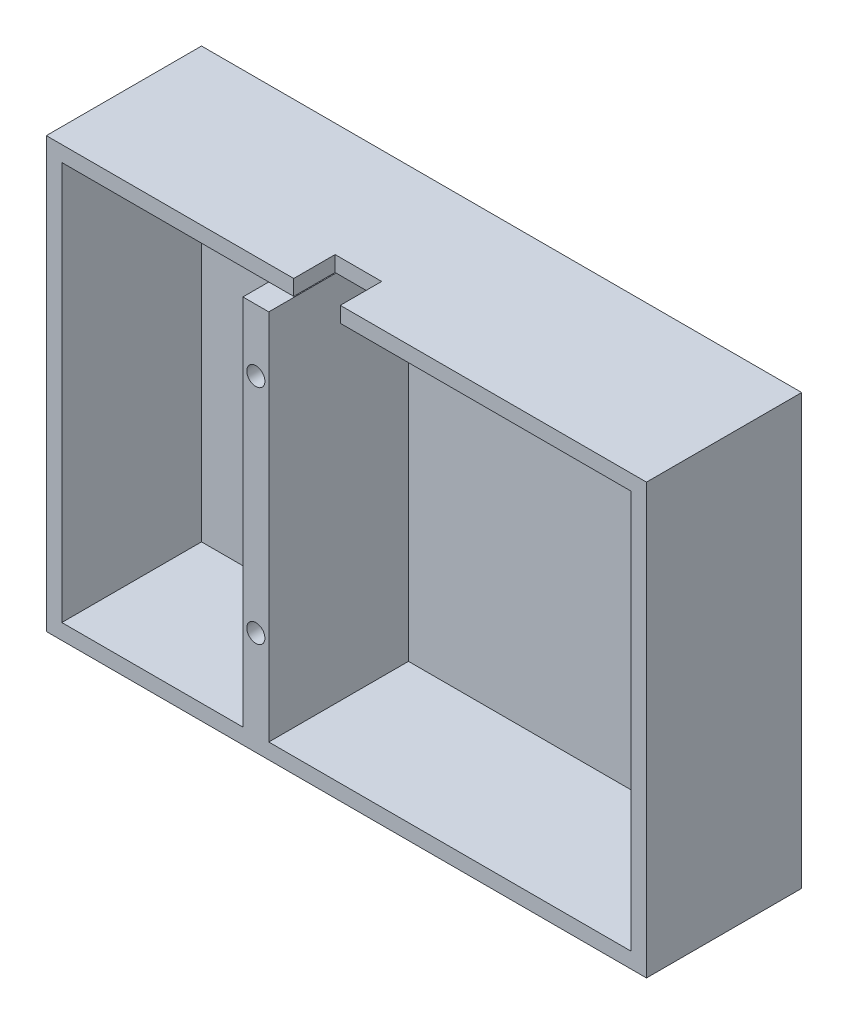
ISO-10303-21;
HEADER;
FILE_DESCRIPTION(('STEP AP214'),'2;1');
FILE_NAME('part.step','',(''),(''),'','','');
FILE_SCHEMA(('AUTOMOTIVE_DESIGN { 1 0 10303 214 1 1 1 1 }'));
ENDSEC;
DATA;
#1=APPLICATION_CONTEXT('core data for automotive mechanical design processes');
#2=APPLICATION_PROTOCOL_DEFINITION('international standard','automotive_design',2000,#1);
#3=PRODUCT_CONTEXT('',#1,'mechanical');
#4=PRODUCT('Part','Part','',(#3));
#5=PRODUCT_RELATED_PRODUCT_CATEGORY('part','',(#4));
#6=PRODUCT_DEFINITION_FORMATION('','',#4);
#7=PRODUCT_DEFINITION_CONTEXT('part definition',#1,'design');
#8=PRODUCT_DEFINITION('design','',#6,#7);
#9=PRODUCT_DEFINITION_SHAPE('','',#8);
#10=(LENGTH_UNIT() NAMED_UNIT(*) SI_UNIT(.MILLI.,.METRE.));
#11=(NAMED_UNIT(*) PLANE_ANGLE_UNIT() SI_UNIT($,.RADIAN.));
#12=(NAMED_UNIT(*) SI_UNIT($,.STERADIAN.) SOLID_ANGLE_UNIT());
#13=UNCERTAINTY_MEASURE_WITH_UNIT(LENGTH_MEASURE(1.E-05),#10,'distance_accuracy_value','');
#14=(GEOMETRIC_REPRESENTATION_CONTEXT(3) GLOBAL_UNCERTAINTY_ASSIGNED_CONTEXT((#13)) GLOBAL_UNIT_ASSIGNED_CONTEXT((#10,
#11,#12)) REPRESENTATION_CONTEXT('',''));
#15=CARTESIAN_POINT('',(0.,0.,0.));
#16=DIRECTION('',(0.,0.,1.));
#17=DIRECTION('',(1.,0.,0.));
#18=AXIS2_PLACEMENT_3D('',#15,#16,#17);
#19=CARTESIAN_POINT('',(0.,0.,30.));
#20=DIRECTION('',(0.,0.,1.));
#21=DIRECTION('',(1.,0.,0.));
#22=AXIS2_PLACEMENT_3D('',#19,#20,#21);
#23=PLANE('',#22);
#24=CARTESIAN_POINT('',(-75.5,63.,30.));
#25=DIRECTION('',(0.,0.,1.));
#26=DIRECTION('',(1.,0.,0.));
#27=AXIS2_PLACEMENT_3D('',#24,#25,#26);
#28=CIRCLE('',#27,1.75);
#29=CARTESIAN_POINT('',(-73.75,63.,30.));
#30=VERTEX_POINT('',#29);
#31=EDGE_CURVE('E180',#30,#30,#28,.T.);
#32=ORIENTED_EDGE('',*,*,#31,.F.);
#33=EDGE_LOOP('',(#32));
#34=FACE_BOUND('',#33,.T.);
#35=CARTESIAN_POINT('',(-75.5,20.,30.));
#36=DIRECTION('',(0.,0.,1.));
#37=DIRECTION('',(1.,0.,0.));
#38=AXIS2_PLACEMENT_3D('',#35,#36,#37);
#39=CIRCLE('',#38,1.75);
#40=CARTESIAN_POINT('',(-73.75,20.,30.));
#41=VERTEX_POINT('',#40);
#42=EDGE_CURVE('E172',#41,#41,#39,.T.);
#43=ORIENTED_EDGE('',*,*,#42,.F.);
#44=EDGE_LOOP('',(#43));
#45=FACE_BOUND('',#44,.T.);
#46=DIRECTION('',(-1.,0.,0.));
#47=VECTOR('',#46,1.);
#48=CARTESIAN_POINT('',(-116.,83.,30.));
#49=LINE('',#48,#47);
#50=CARTESIAN_POINT('',(0.,83.,30.));
#51=VERTEX_POINT('',#50);
#52=CARTESIAN_POINT('',(-59.1821793356738,83.,30.));
#53=VERTEX_POINT('',#52);
#54=EDGE_CURVE('E266',#51,#53,#49,.T.);
#55=ORIENTED_EDGE('',*,*,#54,.T.);
#56=DIRECTION('',(0.,1.,0.));
#57=VECTOR('',#56,1.);
#58=CARTESIAN_POINT('',(-59.1821793356738,73.,30.));
#59=LINE('',#58,#57);
#60=CARTESIAN_POINT('',(-59.1821793356738,80.,30.));
#61=VERTEX_POINT('',#60);
#62=EDGE_CURVE('E161',#61,#53,#59,.T.);
#63=ORIENTED_EDGE('',*,*,#62,.F.);
#64=DIRECTION('',(-1.,0.,0.));
#65=VECTOR('',#64,1.);
#66=CARTESIAN_POINT('',(-73.,80.,30.));
#67=LINE('',#66,#65);
#68=CARTESIAN_POINT('',(-3.,80.,30.));
#69=VERTEX_POINT('',#68);
#70=EDGE_CURVE('E244',#69,#61,#67,.T.);
#71=ORIENTED_EDGE('',*,*,#70,.F.);
#72=DIRECTION('',(0.,1.,0.));
#73=VECTOR('',#72,1.);
#74=CARTESIAN_POINT('',(-3.,80.,30.));
#75=LINE('',#74,#73);
#76=CARTESIAN_POINT('',(-3.00000000000002,3.00000000000004,30.));
#77=VERTEX_POINT('',#76);
#78=EDGE_CURVE('E240',#77,#69,#75,.T.);
#79=ORIENTED_EDGE('',*,*,#78,.F.);
#80=DIRECTION('',(1.,0.,0.));
#81=VECTOR('',#80,1.);
#82=CARTESIAN_POINT('',(-73.,3.00000000000005,30.));
#83=LINE('',#82,#81);
#84=CARTESIAN_POINT('',(-73.,3.00000000000005,30.));
#85=VERTEX_POINT('',#84);
#86=EDGE_CURVE('E238',#85,#77,#83,.T.);
#87=ORIENTED_EDGE('',*,*,#86,.F.);
#88=DIRECTION('',(0.,-1.,0.));
#89=VECTOR('',#88,1.);
#90=CARTESIAN_POINT('',(-73.,80.,30.));
#91=LINE('',#90,#89);
#92=CARTESIAN_POINT('',(-73.,75.,30.));
#93=VERTEX_POINT('',#92);
#94=EDGE_CURVE('E236',#93,#85,#91,.T.);
#95=ORIENTED_EDGE('',*,*,#94,.F.);
#96=DIRECTION('',(1.,0.,0.));
#97=VECTOR('',#96,1.);
#98=CARTESIAN_POINT('',(-78.,75.,30.));
#99=LINE('',#98,#97);
#100=CARTESIAN_POINT('',(-78.,75.,30.));
#101=VERTEX_POINT('',#100);
#102=EDGE_CURVE('E196',#101,#93,#99,.T.);
#103=ORIENTED_EDGE('',*,*,#102,.F.);
#104=DIRECTION('',(0.,1.,0.));
#105=VECTOR('',#104,1.);
#106=CARTESIAN_POINT('',(-78.,80.,30.));
#107=LINE('',#106,#105);
#108=CARTESIAN_POINT('',(-78.,3.,30.));
#109=VERTEX_POINT('',#108);
#110=EDGE_CURVE('E224',#109,#101,#107,.T.);
#111=ORIENTED_EDGE('',*,*,#110,.F.);
#112=DIRECTION('',(1.,0.,0.));
#113=VECTOR('',#112,1.);
#114=CARTESIAN_POINT('',(-113.,3.,30.));
#115=LINE('',#114,#113);
#116=CARTESIAN_POINT('',(-113.,3.,30.));
#117=VERTEX_POINT('',#116);
#118=EDGE_CURVE('E222',#117,#109,#115,.T.);
#119=ORIENTED_EDGE('',*,*,#118,.F.);
#120=DIRECTION('',(0.,-1.,0.));
#121=VECTOR('',#120,1.);
#122=CARTESIAN_POINT('',(-113.,80.,30.));
#123=LINE('',#122,#121);
#124=CARTESIAN_POINT('',(-113.,80.,30.));
#125=VERTEX_POINT('',#124);
#126=EDGE_CURVE('E220',#125,#117,#123,.T.);
#127=ORIENTED_EDGE('',*,*,#126,.F.);
#128=CARTESIAN_POINT('',(-68.1821793356738,80.,30.));
#129=VERTEX_POINT('',#128);
#130=EDGE_CURVE('E243',#129,#125,#67,.T.);
#131=ORIENTED_EDGE('',*,*,#130,.F.);
#132=DIRECTION('',(0.,1.,0.));
#133=VECTOR('',#132,1.);
#134=CARTESIAN_POINT('',(-68.1821793356738,73.,30.));
#135=LINE('',#134,#133);
#136=CARTESIAN_POINT('',(-68.1821793356738,83.,30.));
#137=VERTEX_POINT('',#136);
#138=EDGE_CURVE('E173',#129,#137,#135,.T.);
#139=ORIENTED_EDGE('',*,*,#138,.T.);
#140=CARTESIAN_POINT('',(-116.,83.,30.));
#141=VERTEX_POINT('',#140);
#142=EDGE_CURVE('E265',#137,#141,#49,.T.);
#143=ORIENTED_EDGE('',*,*,#142,.T.);
#144=DIRECTION('',(0.,-1.,0.));
#145=VECTOR('',#144,1.);
#146=CARTESIAN_POINT('',(-116.,83.,30.));
#147=LINE('',#146,#145);
#148=CARTESIAN_POINT('',(-116.,0.,30.));
#149=VERTEX_POINT('',#148);
#150=EDGE_CURVE('E257',#141,#149,#147,.T.);
#151=ORIENTED_EDGE('',*,*,#150,.T.);
#152=DIRECTION('',(1.,0.,0.));
#153=VECTOR('',#152,1.);
#154=CARTESIAN_POINT('',(-116.,0.,30.));
#155=LINE('',#154,#153);
#156=CARTESIAN_POINT('',(0.,0.,30.));
#157=VERTEX_POINT('',#156);
#158=EDGE_CURVE('E260',#149,#157,#155,.T.);
#159=ORIENTED_EDGE('',*,*,#158,.T.);
#160=DIRECTION('',(0.,1.,0.));
#161=VECTOR('',#160,1.);
#162=CARTESIAN_POINT('',(0.,83.,30.));
#163=LINE('',#162,#161);
#164=EDGE_CURVE('E263',#157,#51,#163,.T.);
#165=ORIENTED_EDGE('',*,*,#164,.T.);
#166=EDGE_LOOP('',(#55,#63,#71,#79,#87,#95,#103,#111,#119,#127,#131,#139,#143,#151,#159,#165));
#167=FACE_BOUND('',#166,.T.);
#168=ADVANCED_FACE('F33',(#34,#45,#167),#23,.T.);
#169=CARTESIAN_POINT('',(-116.,83.,30.));
#170=DIRECTION('',(0.,-1.,0.));
#171=DIRECTION('',(0.,0.,-1.));
#172=AXIS2_PLACEMENT_3D('',#169,#170,#171);
#173=PLANE('',#172);
#174=DIRECTION('',(0.,0.,1.));
#175=VECTOR('',#174,1.);
#176=CARTESIAN_POINT('',(-59.1821793356738,83.,0.));
#177=LINE('',#176,#175);
#178=CARTESIAN_POINT('',(-59.1821793356738,83.,22.));
#179=VERTEX_POINT('',#178);
#180=EDGE_CURVE('E158',#179,#53,#177,.T.);
#181=ORIENTED_EDGE('',*,*,#180,.T.);
#182=ORIENTED_EDGE('',*,*,#54,.F.);
#183=DIRECTION('',(0.,0.,-1.));
#184=VECTOR('',#183,1.);
#185=CARTESIAN_POINT('',(0.,83.,30.));
#186=LINE('',#185,#184);
#187=CARTESIAN_POINT('',(0.,83.,0.));
#188=VERTEX_POINT('',#187);
#189=EDGE_CURVE('E278',#51,#188,#186,.T.);
#190=ORIENTED_EDGE('',*,*,#189,.T.);
#191=DIRECTION('',(-1.,0.,0.));
#192=VECTOR('',#191,1.);
#193=CARTESIAN_POINT('',(-116.,83.,0.));
#194=LINE('',#193,#192);
#195=CARTESIAN_POINT('',(-116.,83.,0.));
#196=VERTEX_POINT('',#195);
#197=EDGE_CURVE('E261',#188,#196,#194,.T.);
#198=ORIENTED_EDGE('',*,*,#197,.T.);
#199=DIRECTION('',(0.,0.,-1.));
#200=VECTOR('',#199,1.);
#201=CARTESIAN_POINT('',(-116.,83.,30.));
#202=LINE('',#201,#200);
#203=EDGE_CURVE('E268',#141,#196,#202,.T.);
#204=ORIENTED_EDGE('',*,*,#203,.F.);
#205=ORIENTED_EDGE('',*,*,#142,.F.);
#206=DIRECTION('',(0.,0.,-1.));
#207=VECTOR('',#206,1.);
#208=CARTESIAN_POINT('',(-68.1821793356738,83.,0.));
#209=LINE('',#208,#207);
#210=CARTESIAN_POINT('',(-68.1821793356738,83.,22.));
#211=VERTEX_POINT('',#210);
#212=EDGE_CURVE('E155',#137,#211,#209,.T.);
#213=ORIENTED_EDGE('',*,*,#212,.T.);
#214=DIRECTION('',(1.,0.,0.));
#215=VECTOR('',#214,1.);
#216=CARTESIAN_POINT('',(0.,83.,22.));
#217=LINE('',#216,#215);
#218=EDGE_CURVE('E150',#211,#179,#217,.T.);
#219=ORIENTED_EDGE('',*,*,#218,.T.);
#220=EDGE_LOOP('',(#181,#182,#190,#198,#204,#205,#213,#219));
#221=FACE_BOUND('',#220,.T.);
#222=ADVANCED_FACE('F166',(#221),#173,.F.);
#223=CARTESIAN_POINT('',(-73.,80.,30.));
#224=DIRECTION('',(0.,-1.,0.));
#225=DIRECTION('',(1.,0.,0.));
#226=AXIS2_PLACEMENT_3D('',#223,#224,#225);
#227=PLANE('',#226);
#228=ORIENTED_EDGE('',*,*,#70,.T.);
#229=DIRECTION('',(0.,0.,-1.));
#230=VECTOR('',#229,1.);
#231=CARTESIAN_POINT('',(-59.1821793356738,80.,30.));
#232=LINE('',#231,#230);
#233=CARTESIAN_POINT('',(-59.1821793356738,80.,22.));
#234=VERTEX_POINT('',#233);
#235=EDGE_CURVE('E11',#61,#234,#232,.T.);
#236=ORIENTED_EDGE('',*,*,#235,.T.);
#237=DIRECTION('',(-1.,0.,0.));
#238=VECTOR('',#237,1.);
#239=CARTESIAN_POINT('',(-73.,80.,22.));
#240=LINE('',#239,#238);
#241=CARTESIAN_POINT('',(-68.1821793356738,80.,22.));
#242=VERTEX_POINT('',#241);
#243=EDGE_CURVE('E153',#234,#242,#240,.T.);
#244=ORIENTED_EDGE('',*,*,#243,.T.);
#245=DIRECTION('',(0.,0.,1.));
#246=VECTOR('',#245,1.);
#247=CARTESIAN_POINT('',(-68.1821793356738,80.,30.));
#248=LINE('',#247,#246);
#249=EDGE_CURVE('E41',#242,#129,#248,.T.);
#250=ORIENTED_EDGE('',*,*,#249,.T.);
#251=ORIENTED_EDGE('',*,*,#130,.T.);
#252=DIRECTION('',(0.,0.,-1.));
#253=VECTOR('',#252,1.);
#254=CARTESIAN_POINT('',(-113.,80.,30.));
#255=LINE('',#254,#253);
#256=CARTESIAN_POINT('',(-113.,80.,3.));
#257=VERTEX_POINT('',#256);
#258=EDGE_CURVE('E227',#125,#257,#255,.T.);
#259=ORIENTED_EDGE('',*,*,#258,.T.);
#260=DIRECTION('',(1.,0.,0.));
#261=VECTOR('',#260,1.);
#262=CARTESIAN_POINT('',(-3.,80.,3.));
#263=LINE('',#262,#261);
#264=CARTESIAN_POINT('',(-3.,80.,3.));
#265=VERTEX_POINT('',#264);
#266=EDGE_CURVE('E216',#257,#265,#263,.T.);
#267=ORIENTED_EDGE('',*,*,#266,.T.);
#268=DIRECTION('',(0.,0.,-1.));
#269=VECTOR('',#268,1.);
#270=CARTESIAN_POINT('',(-3.,80.,30.));
#271=LINE('',#270,#269);
#272=EDGE_CURVE('E247',#69,#265,#271,.T.);
#273=ORIENTED_EDGE('',*,*,#272,.F.);
#274=EDGE_LOOP('',(#228,#236,#244,#250,#251,#259,#267,#273));
#275=FACE_BOUND('',#274,.T.);
#276=ADVANCED_FACE('F290',(#275),#227,.T.);
#277=CARTESIAN_POINT('',(0.,0.,0.));
#278=DIRECTION('',(0.,0.,1.));
#279=DIRECTION('',(1.,0.,0.));
#280=AXIS2_PLACEMENT_3D('',#277,#278,#279);
#281=PLANE('',#280);
#282=CARTESIAN_POINT('',(-75.5,20.,0.));
#283=DIRECTION('',(0.,0.,1.));
#284=DIRECTION('',(1.,0.,0.));
#285=AXIS2_PLACEMENT_3D('',#282,#283,#284);
#286=CIRCLE('',#285,1.75);
#287=CARTESIAN_POINT('',(-73.75,20.,0.));
#288=VERTEX_POINT('',#287);
#289=EDGE_CURVE('E177',#288,#288,#286,.T.);
#290=ORIENTED_EDGE('',*,*,#289,.T.);
#291=EDGE_LOOP('',(#290));
#292=FACE_BOUND('',#291,.T.);
#293=CARTESIAN_POINT('',(-75.5,63.,0.));
#294=DIRECTION('',(0.,0.,1.));
#295=DIRECTION('',(1.,0.,0.));
#296=AXIS2_PLACEMENT_3D('',#293,#294,#295);
#297=CIRCLE('',#296,1.75);
#298=CARTESIAN_POINT('',(-73.75,63.,0.));
#299=VERTEX_POINT('',#298);
#300=EDGE_CURVE('E183',#299,#299,#297,.T.);
#301=ORIENTED_EDGE('',*,*,#300,.T.);
#302=EDGE_LOOP('',(#301));
#303=FACE_BOUND('',#302,.T.);
#304=DIRECTION('',(0.,-1.,0.));
#305=VECTOR('',#304,1.);
#306=CARTESIAN_POINT('',(-116.,83.,0.));
#307=LINE('',#306,#305);
#308=CARTESIAN_POINT('',(-116.,0.,0.));
#309=VERTEX_POINT('',#308);
#310=EDGE_CURVE('E256',#196,#309,#307,.T.);
#311=ORIENTED_EDGE('',*,*,#310,.F.);
#312=ORIENTED_EDGE('',*,*,#197,.F.);
#313=DIRECTION('',(0.,1.,0.));
#314=VECTOR('',#313,1.);
#315=CARTESIAN_POINT('',(0.,83.,0.));
#316=LINE('',#315,#314);
#317=CARTESIAN_POINT('',(0.,0.,0.));
#318=VERTEX_POINT('',#317);
#319=EDGE_CURVE('E273',#318,#188,#316,.T.);
#320=ORIENTED_EDGE('',*,*,#319,.F.);
#321=DIRECTION('',(1.,0.,0.));
#322=VECTOR('',#321,1.);
#323=CARTESIAN_POINT('',(-116.,0.,0.));
#324=LINE('',#323,#322);
#325=EDGE_CURVE('E271',#309,#318,#324,.T.);
#326=ORIENTED_EDGE('',*,*,#325,.F.);
#327=EDGE_LOOP('',(#311,#312,#320,#326));
#328=FACE_BOUND('',#327,.T.);
#329=ADVANCED_FACE('F325',(#292,#303,#328),#281,.F.);
#330=CARTESIAN_POINT('',(-116.,83.,30.));
#331=DIRECTION('',(1.,0.,0.));
#332=DIRECTION('',(0.,1.,0.));
#333=AXIS2_PLACEMENT_3D('',#330,#331,#332);
#334=PLANE('',#333);
#335=ORIENTED_EDGE('',*,*,#310,.T.);
#336=DIRECTION('',(0.,0.,-1.));
#337=VECTOR('',#336,1.);
#338=CARTESIAN_POINT('',(-116.,0.,30.));
#339=LINE('',#338,#337);
#340=EDGE_CURVE('E284',#149,#309,#339,.T.);
#341=ORIENTED_EDGE('',*,*,#340,.F.);
#342=ORIENTED_EDGE('',*,*,#150,.F.);
#343=ORIENTED_EDGE('',*,*,#203,.T.);
#344=EDGE_LOOP('',(#335,#341,#342,#343));
#345=FACE_BOUND('',#344,.T.);
#346=ADVANCED_FACE('F35',(#345),#334,.F.);
#347=CARTESIAN_POINT('',(-116.,0.,30.));
#348=DIRECTION('',(0.,1.,0.));
#349=DIRECTION('',(0.,0.,1.));
#350=AXIS2_PLACEMENT_3D('',#347,#348,#349);
#351=PLANE('',#350);
#352=CARTESIAN_POINT('',(-12.5,0.,8.));
#353=DIRECTION('',(0.,-1.,0.));
#354=DIRECTION('',(0.,0.,-1.));
#355=AXIS2_PLACEMENT_3D('',#352,#353,#354);
#356=CIRCLE('',#355,5.);
#357=CARTESIAN_POINT('',(-12.5,0.,3.));
#358=VERTEX_POINT('',#357);
#359=EDGE_CURVE('E186',#358,#358,#356,.T.);
#360=ORIENTED_EDGE('',*,*,#359,.F.);
#361=EDGE_LOOP('',(#360));
#362=FACE_BOUND('',#361,.T.);
#363=ORIENTED_EDGE('',*,*,#325,.T.);
#364=DIRECTION('',(0.,0.,-1.));
#365=VECTOR('',#364,1.);
#366=CARTESIAN_POINT('',(0.,0.,30.));
#367=LINE('',#366,#365);
#368=EDGE_CURVE('E281',#157,#318,#367,.T.);
#369=ORIENTED_EDGE('',*,*,#368,.F.);
#370=ORIENTED_EDGE('',*,*,#158,.F.);
#371=ORIENTED_EDGE('',*,*,#340,.T.);
#372=EDGE_LOOP('',(#363,#369,#370,#371));
#373=FACE_BOUND('',#372,.T.);
#374=ADVANCED_FACE('F331',(#362,#373),#351,.F.);
#375=CARTESIAN_POINT('',(0.,83.,30.));
#376=DIRECTION('',(-1.,0.,0.));
#377=DIRECTION('',(0.,0.,1.));
#378=AXIS2_PLACEMENT_3D('',#375,#376,#377);
#379=PLANE('',#378);
#380=ORIENTED_EDGE('',*,*,#319,.T.);
#381=ORIENTED_EDGE('',*,*,#189,.F.);
#382=ORIENTED_EDGE('',*,*,#164,.F.);
#383=ORIENTED_EDGE('',*,*,#368,.T.);
#384=EDGE_LOOP('',(#380,#381,#382,#383));
#385=FACE_BOUND('',#384,.T.);
#386=ADVANCED_FACE('F332',(#385),#379,.F.);
#387=CARTESIAN_POINT('',(-73.,80.,30.));
#388=DIRECTION('',(1.,0.,0.));
#389=DIRECTION('',(0.,1.,0.));
#390=AXIS2_PLACEMENT_3D('',#387,#388,#389);
#391=PLANE('',#390);
#392=DIRECTION('',(0.,0.,-1.));
#393=VECTOR('',#392,1.);
#394=CARTESIAN_POINT('',(-73.,75.,30.));
#395=LINE('',#394,#393);
#396=CARTESIAN_POINT('',(-73.,75.,3.00000000000001));
#397=VERTEX_POINT('',#396);
#398=EDGE_CURVE('E192',#93,#397,#395,.T.);
#399=ORIENTED_EDGE('',*,*,#398,.F.);
#400=ORIENTED_EDGE('',*,*,#94,.T.);
#401=DIRECTION('',(0.,0.,-1.));
#402=VECTOR('',#401,1.);
#403=CARTESIAN_POINT('',(-73.,3.00000000000005,30.));
#404=LINE('',#403,#402);
#405=CARTESIAN_POINT('',(-73.,3.00000000000005,3.));
#406=VERTEX_POINT('',#405);
#407=EDGE_CURVE('E253',#85,#406,#404,.T.);
#408=ORIENTED_EDGE('',*,*,#407,.T.);
#409=DIRECTION('',(0.,1.,0.));
#410=VECTOR('',#409,1.);
#411=CARTESIAN_POINT('',(-73.,80.,3.));
#412=LINE('',#411,#410);
#413=EDGE_CURVE('E213',#406,#397,#412,.T.);
#414=ORIENTED_EDGE('',*,*,#413,.T.);
#415=EDGE_LOOP('',(#399,#400,#408,#414));
#416=FACE_BOUND('',#415,.T.);
#417=ADVANCED_FACE('F334',(#416),#391,.T.);
#418=CARTESIAN_POINT('',(-73.,3.00000000000005,30.));
#419=DIRECTION('',(0.,1.,0.));
#420=DIRECTION('',(-1.,0.,0.));
#421=AXIS2_PLACEMENT_3D('',#418,#419,#420);
#422=PLANE('',#421);
#423=DIRECTION('',(-1.,0.,0.));
#424=VECTOR('',#423,1.);
#425=CARTESIAN_POINT('',(-73.,3.00000000000005,3.));
#426=LINE('',#425,#424);
#427=CARTESIAN_POINT('',(-3.00000000000002,3.00000000000004,3.));
#428=VERTEX_POINT('',#427);
#429=CARTESIAN_POINT('',(-12.5,3.00000000000004,3.));
#430=VERTEX_POINT('',#429);
#431=EDGE_CURVE('E210',#428,#430,#426,.T.);
#432=ORIENTED_EDGE('',*,*,#431,.T.);
#433=CARTESIAN_POINT('',(-12.5,3.00000000000005,8.));
#434=DIRECTION('',(0.,1.,0.));
#435=DIRECTION('',(-1.,0.,0.));
#436=AXIS2_PLACEMENT_3D('',#433,#434,#435);
#437=CIRCLE('',#436,5.);
#438=EDGE_CURVE('E54',#430,#430,#437,.T.);
#439=ORIENTED_EDGE('',*,*,#438,.F.);
#440=EDGE_CURVE('E209',#430,#406,#426,.T.);
#441=ORIENTED_EDGE('',*,*,#440,.T.);
#442=ORIENTED_EDGE('',*,*,#407,.F.);
#443=ORIENTED_EDGE('',*,*,#86,.T.);
#444=DIRECTION('',(0.,0.,-1.));
#445=VECTOR('',#444,1.);
#446=CARTESIAN_POINT('',(-3.00000000000002,3.00000000000004,30.));
#447=LINE('',#446,#445);
#448=EDGE_CURVE('E250',#77,#428,#447,.T.);
#449=ORIENTED_EDGE('',*,*,#448,.T.);
#450=EDGE_LOOP('',(#432,#439,#441,#442,#443,#449));
#451=FACE_BOUND('',#450,.T.);
#452=ADVANCED_FACE('F340',(#451),#422,.T.);
#453=CARTESIAN_POINT('',(-3.,80.,30.));
#454=DIRECTION('',(-1.,0.,0.));
#455=DIRECTION('',(0.,-1.,0.));
#456=AXIS2_PLACEMENT_3D('',#453,#454,#455);
#457=PLANE('',#456);
#458=DIRECTION('',(0.,-1.,0.));
#459=VECTOR('',#458,1.);
#460=CARTESIAN_POINT('',(-3.00000000000002,3.00000000000004,3.));
#461=LINE('',#460,#459);
#462=EDGE_CURVE('E218',#265,#428,#461,.T.);
#463=ORIENTED_EDGE('',*,*,#462,.T.);
#464=ORIENTED_EDGE('',*,*,#448,.F.);
#465=ORIENTED_EDGE('',*,*,#78,.T.);
#466=ORIENTED_EDGE('',*,*,#272,.T.);
#467=EDGE_LOOP('',(#463,#464,#465,#466));
#468=FACE_BOUND('',#467,.T.);
#469=ADVANCED_FACE('F312',(#468),#457,.T.);
#470=CARTESIAN_POINT('',(-113.,80.,30.));
#471=DIRECTION('',(1.,0.,0.));
#472=DIRECTION('',(0.,1.,0.));
#473=AXIS2_PLACEMENT_3D('',#470,#471,#472);
#474=PLANE('',#473);
#475=DIRECTION('',(0.,1.,0.));
#476=VECTOR('',#475,1.);
#477=CARTESIAN_POINT('',(-113.,80.,3.));
#478=LINE('',#477,#476);
#479=CARTESIAN_POINT('',(-113.,3.,3.));
#480=VERTEX_POINT('',#479);
#481=EDGE_CURVE('E201',#480,#257,#478,.T.);
#482=ORIENTED_EDGE('',*,*,#481,.T.);
#483=ORIENTED_EDGE('',*,*,#258,.F.);
#484=ORIENTED_EDGE('',*,*,#126,.T.);
#485=DIRECTION('',(0.,0.,-1.));
#486=VECTOR('',#485,1.);
#487=CARTESIAN_POINT('',(-113.,3.,30.));
#488=LINE('',#487,#486);
#489=EDGE_CURVE('E233',#117,#480,#488,.T.);
#490=ORIENTED_EDGE('',*,*,#489,.T.);
#491=EDGE_LOOP('',(#482,#483,#484,#490));
#492=FACE_BOUND('',#491,.T.);
#493=ADVANCED_FACE('F299',(#492),#474,.T.);
#494=CARTESIAN_POINT('',(-113.,3.,30.));
#495=DIRECTION('',(0.,1.,0.));
#496=DIRECTION('',(0.,0.,1.));
#497=AXIS2_PLACEMENT_3D('',#494,#495,#496);
#498=PLANE('',#497);
#499=DIRECTION('',(-1.,0.,0.));
#500=VECTOR('',#499,1.);
#501=CARTESIAN_POINT('',(-113.,3.,3.));
#502=LINE('',#501,#500);
#503=CARTESIAN_POINT('',(-78.,3.,3.));
#504=VERTEX_POINT('',#503);
#505=EDGE_CURVE('E207',#504,#480,#502,.T.);
#506=ORIENTED_EDGE('',*,*,#505,.T.);
#507=ORIENTED_EDGE('',*,*,#489,.F.);
#508=ORIENTED_EDGE('',*,*,#118,.T.);
#509=DIRECTION('',(0.,0.,-1.));
#510=VECTOR('',#509,1.);
#511=CARTESIAN_POINT('',(-78.,3.,30.));
#512=LINE('',#511,#510);
#513=EDGE_CURVE('E230',#109,#504,#512,.T.);
#514=ORIENTED_EDGE('',*,*,#513,.T.);
#515=EDGE_LOOP('',(#506,#507,#508,#514));
#516=FACE_BOUND('',#515,.T.);
#517=ADVANCED_FACE('F302',(#516),#498,.T.);
#518=CARTESIAN_POINT('',(-78.,80.,30.));
#519=DIRECTION('',(-1.,0.,0.));
#520=DIRECTION('',(0.,-1.,0.));
#521=AXIS2_PLACEMENT_3D('',#518,#519,#520);
#522=PLANE('',#521);
#523=DIRECTION('',(0.,0.,-1.));
#524=VECTOR('',#523,1.);
#525=CARTESIAN_POINT('',(-78.,75.,30.));
#526=LINE('',#525,#524);
#527=CARTESIAN_POINT('',(-78.,75.,3.00000000000001));
#528=VERTEX_POINT('',#527);
#529=EDGE_CURVE('E193',#101,#528,#526,.T.);
#530=ORIENTED_EDGE('',*,*,#529,.T.);
#531=DIRECTION('',(0.,-1.,0.));
#532=VECTOR('',#531,1.);
#533=CARTESIAN_POINT('',(-78.,3.,3.));
#534=LINE('',#533,#532);
#535=EDGE_CURVE('E205',#528,#504,#534,.T.);
#536=ORIENTED_EDGE('',*,*,#535,.T.);
#537=ORIENTED_EDGE('',*,*,#513,.F.);
#538=ORIENTED_EDGE('',*,*,#110,.T.);
#539=EDGE_LOOP('',(#530,#536,#537,#538));
#540=FACE_BOUND('',#539,.T.);
#541=ADVANCED_FACE('F387',(#540),#522,.T.);
#542=CARTESIAN_POINT('',(0.,0.,3.));
#543=DIRECTION('',(0.,0.,1.));
#544=DIRECTION('',(1.,0.,0.));
#545=AXIS2_PLACEMENT_3D('',#542,#543,#544);
#546=PLANE('',#545);
#547=ORIENTED_EDGE('',*,*,#440,.F.);
#548=ORIENTED_EDGE('',*,*,#431,.F.);
#549=ORIENTED_EDGE('',*,*,#462,.F.);
#550=ORIENTED_EDGE('',*,*,#266,.F.);
#551=ORIENTED_EDGE('',*,*,#481,.F.);
#552=ORIENTED_EDGE('',*,*,#505,.F.);
#553=ORIENTED_EDGE('',*,*,#535,.F.);
#554=DIRECTION('',(1.,0.,0.));
#555=VECTOR('',#554,1.);
#556=CARTESIAN_POINT('',(-78.,75.,3.00000000000001));
#557=LINE('',#556,#555);
#558=EDGE_CURVE('E199',#528,#397,#557,.T.);
#559=ORIENTED_EDGE('',*,*,#558,.T.);
#560=ORIENTED_EDGE('',*,*,#413,.F.);
#561=EDGE_LOOP('',(#547,#548,#549,#550,#551,#552,#553,#559,#560));
#562=FACE_BOUND('',#561,.T.);
#563=ADVANCED_FACE('F308',(#562),#546,.T.);
#564=CARTESIAN_POINT('',(-78.,75.,30.));
#565=DIRECTION('',(0.,-1.,0.));
#566=DIRECTION('',(0.,0.,-1.));
#567=AXIS2_PLACEMENT_3D('',#564,#565,#566);
#568=PLANE('',#567);
#569=ORIENTED_EDGE('',*,*,#398,.T.);
#570=ORIENTED_EDGE('',*,*,#558,.F.);
#571=ORIENTED_EDGE('',*,*,#529,.F.);
#572=ORIENTED_EDGE('',*,*,#102,.T.);
#573=EDGE_LOOP('',(#569,#570,#571,#572));
#574=FACE_BOUND('',#573,.T.);
#575=ADVANCED_FACE('F378',(#574),#568,.F.);
#576=CARTESIAN_POINT('',(-12.5,10.,8.));
#577=DIRECTION('',(0.,-1.,0.));
#578=DIRECTION('',(0.,0.,-1.));
#579=AXIS2_PLACEMENT_3D('',#576,#577,#578);
#580=CYLINDRICAL_SURFACE('',#579,5.);
#581=ORIENTED_EDGE('',*,*,#438,.T.);
#582=EDGE_LOOP('',(#581));
#583=FACE_BOUND('',#582,.T.);
#584=ORIENTED_EDGE('',*,*,#359,.T.);
#585=EDGE_LOOP('',(#584));
#586=FACE_BOUND('',#585,.T.);
#587=ADVANCED_FACE('F370',(#583,#586),#580,.F.);
#588=CARTESIAN_POINT('',(-75.5,63.,0.));
#589=DIRECTION('',(0.,0.,1.));
#590=DIRECTION('',(1.,0.,0.));
#591=AXIS2_PLACEMENT_3D('',#588,#589,#590);
#592=CYLINDRICAL_SURFACE('',#591,1.75);
#593=ORIENTED_EDGE('',*,*,#300,.F.);
#594=EDGE_LOOP('',(#593));
#595=FACE_BOUND('',#594,.T.);
#596=ORIENTED_EDGE('',*,*,#31,.T.);
#597=EDGE_LOOP('',(#596));
#598=FACE_BOUND('',#597,.T.);
#599=ADVANCED_FACE('F366',(#595,#598),#592,.F.);
#600=CARTESIAN_POINT('',(-75.5,20.,0.));
#601=DIRECTION('',(0.,0.,1.));
#602=DIRECTION('',(1.,0.,0.));
#603=AXIS2_PLACEMENT_3D('',#600,#601,#602);
#604=CYLINDRICAL_SURFACE('',#603,1.75);
#605=ORIENTED_EDGE('',*,*,#289,.F.);
#606=EDGE_LOOP('',(#605));
#607=FACE_BOUND('',#606,.T.);
#608=ORIENTED_EDGE('',*,*,#42,.T.);
#609=EDGE_LOOP('',(#608));
#610=FACE_BOUND('',#609,.T.);
#611=ADVANCED_FACE('F369',(#607,#610),#604,.F.);
#612=CARTESIAN_POINT('',(-59.1821793356738,73.,0.));
#613=DIRECTION('',(-1.,0.,0.));
#614=DIRECTION('',(0.,0.,1.));
#615=AXIS2_PLACEMENT_3D('',#612,#613,#614);
#616=PLANE('',#615);
#617=ORIENTED_EDGE('',*,*,#62,.T.);
#618=ORIENTED_EDGE('',*,*,#180,.F.);
#619=DIRECTION('',(0.,1.,0.));
#620=VECTOR('',#619,1.);
#621=CARTESIAN_POINT('',(-59.1821793356738,73.,22.));
#622=LINE('',#621,#620);
#623=EDGE_CURVE('E146',#234,#179,#622,.T.);
#624=ORIENTED_EDGE('',*,*,#623,.F.);
#625=ORIENTED_EDGE('',*,*,#235,.F.);
#626=EDGE_LOOP('',(#617,#618,#624,#625));
#627=FACE_BOUND('',#626,.T.);
#628=ADVANCED_FACE('F159',(#627),#616,.T.);
#629=CARTESIAN_POINT('',(-68.1821793356738,73.,0.));
#630=DIRECTION('',(1.,0.,0.));
#631=DIRECTION('',(0.,0.,-1.));
#632=AXIS2_PLACEMENT_3D('',#629,#630,#631);
#633=PLANE('',#632);
#634=DIRECTION('',(0.,1.,0.));
#635=VECTOR('',#634,1.);
#636=CARTESIAN_POINT('',(-68.1821793356738,73.,22.));
#637=LINE('',#636,#635);
#638=EDGE_CURVE('E48',#242,#211,#637,.T.);
#639=ORIENTED_EDGE('',*,*,#638,.T.);
#640=ORIENTED_EDGE('',*,*,#212,.F.);
#641=ORIENTED_EDGE('',*,*,#138,.F.);
#642=ORIENTED_EDGE('',*,*,#249,.F.);
#643=EDGE_LOOP('',(#639,#640,#641,#642));
#644=FACE_BOUND('',#643,.T.);
#645=ADVANCED_FACE('F479',(#644),#633,.T.);
#646=CARTESIAN_POINT('',(0.,73.,22.));
#647=DIRECTION('',(0.,0.,1.));
#648=DIRECTION('',(1.,0.,0.));
#649=AXIS2_PLACEMENT_3D('',#646,#647,#648);
#650=PLANE('',#649);
#651=ORIENTED_EDGE('',*,*,#623,.T.);
#652=ORIENTED_EDGE('',*,*,#218,.F.);
#653=ORIENTED_EDGE('',*,*,#638,.F.);
#654=ORIENTED_EDGE('',*,*,#243,.F.);
#655=EDGE_LOOP('',(#651,#652,#653,#654));
#656=FACE_BOUND('',#655,.T.);
#657=ADVANCED_FACE('F148',(#656),#650,.T.);
#658=CLOSED_SHELL('',(#168,#222,#276,#329,#346,#374,#386,#417,#452,#469,#493,#517,#541,#563,
#575,#587,#599,#611,#628,#645,#657));
#659=MANIFOLD_SOLID_BREP('B2',#658);
#660=ADVANCED_BREP_SHAPE_REPRESENTATION('',(#18,#659),#14);
#661=SHAPE_DEFINITION_REPRESENTATION(#9,#660);
ENDSEC;
END-ISO-10303-21;
